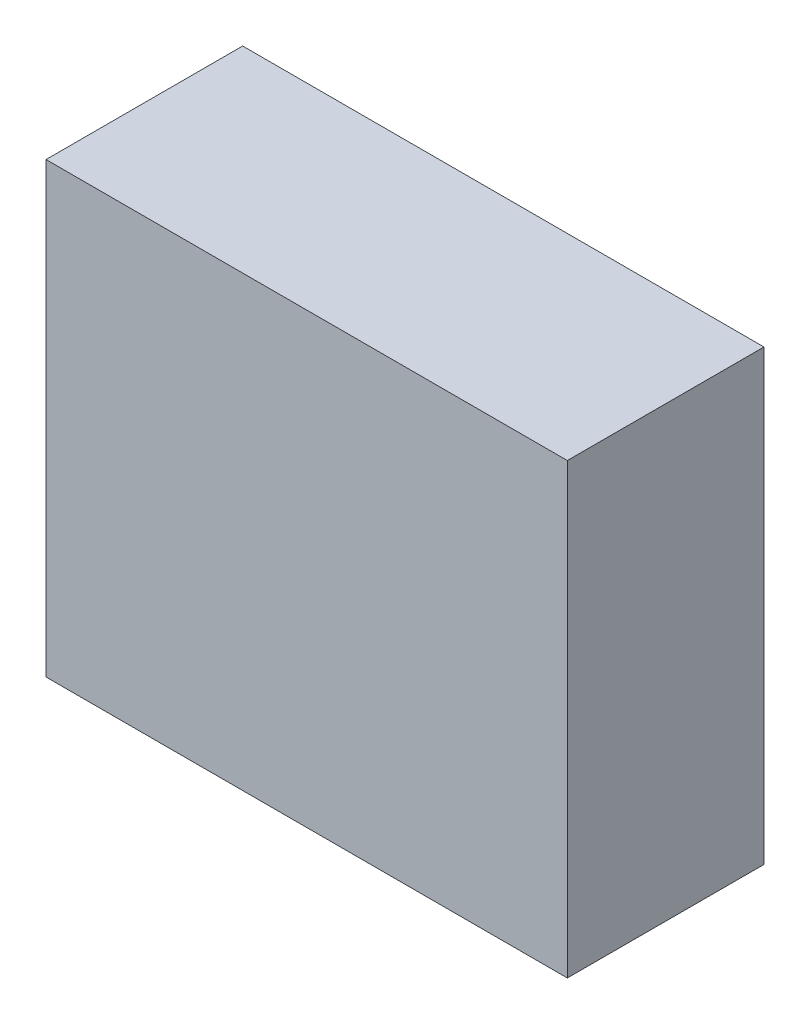
ISO-10303-21;
HEADER;
FILE_DESCRIPTION(('STEP AP214'),'2;1');
FILE_NAME('part.step','',(''),(''),'','','');
FILE_SCHEMA(('AUTOMOTIVE_DESIGN { 1 0 10303 214 1 1 1 1 }'));
ENDSEC;
DATA;
#1=APPLICATION_CONTEXT('core data for automotive mechanical design processes');
#2=APPLICATION_PROTOCOL_DEFINITION('international standard','automotive_design',2000,#1);
#3=PRODUCT_CONTEXT('',#1,'mechanical');
#4=PRODUCT('Part','Part','',(#3));
#5=PRODUCT_RELATED_PRODUCT_CATEGORY('part','',(#4));
#6=PRODUCT_DEFINITION_FORMATION('','',#4);
#7=PRODUCT_DEFINITION_CONTEXT('part definition',#1,'design');
#8=PRODUCT_DEFINITION('design','',#6,#7);
#9=PRODUCT_DEFINITION_SHAPE('','',#8);
#10=(LENGTH_UNIT() NAMED_UNIT(*) SI_UNIT(.MILLI.,.METRE.));
#11=(NAMED_UNIT(*) PLANE_ANGLE_UNIT() SI_UNIT($,.RADIAN.));
#12=(NAMED_UNIT(*) SI_UNIT($,.STERADIAN.) SOLID_ANGLE_UNIT());
#13=UNCERTAINTY_MEASURE_WITH_UNIT(LENGTH_MEASURE(1.E-05),#10,'distance_accuracy_value','');
#14=(GEOMETRIC_REPRESENTATION_CONTEXT(3) GLOBAL_UNCERTAINTY_ASSIGNED_CONTEXT((#13)) GLOBAL_UNIT_ASSIGNED_CONTEXT((#10,
#11,#12)) REPRESENTATION_CONTEXT('',''));
#15=CARTESIAN_POINT('',(0.,0.,0.));
#16=DIRECTION('',(0.,0.,1.));
#17=DIRECTION('',(1.,0.,0.));
#18=AXIS2_PLACEMENT_3D('',#15,#16,#17);
#19=CARTESIAN_POINT('',(62.465712,52.602384,1.82372));
#20=DIRECTION('',(0.,0.,1.));
#21=DIRECTION('',(-1.,0.,0.));
#22=AXIS2_PLACEMENT_3D('',#19,#20,#21);
#23=PLANE('',#22);
#24=DIRECTION('',(-1.,0.,0.));
#25=VECTOR('',#24,1.);
#26=CARTESIAN_POINT('',(60.96,50.0634,1.82372));
#27=LINE('',#26,#25);
#28=CARTESIAN_POINT('',(59.5122,50.0634,1.82372));
#29=VERTEX_POINT('',#28);
#30=CARTESIAN_POINT('',(62.4078,50.0634,1.82372));
#31=VERTEX_POINT('',#30);
#32=EDGE_CURVE('E76',#29,#31,#27,.F.);
#33=ORIENTED_EDGE('',*,*,#32,.T.);
#34=DIRECTION('',(0.,-1.,0.));
#35=VECTOR('',#34,1.);
#36=CARTESIAN_POINT('',(62.4078,51.308,1.82372));
#37=LINE('',#36,#35);
#38=CARTESIAN_POINT('',(62.4078,52.5526,1.82372));
#39=VERTEX_POINT('',#38);
#40=EDGE_CURVE('E58',#31,#39,#37,.F.);
#41=ORIENTED_EDGE('',*,*,#40,.T.);
#42=DIRECTION('',(1.,0.,0.));
#43=VECTOR('',#42,1.);
#44=CARTESIAN_POINT('',(60.96,52.5526,1.82372));
#45=LINE('',#44,#43);
#46=CARTESIAN_POINT('',(59.5122,52.5526,1.82372));
#47=VERTEX_POINT('',#46);
#48=EDGE_CURVE('E20',#39,#47,#45,.F.);
#49=ORIENTED_EDGE('',*,*,#48,.T.);
#50=DIRECTION('',(0.,1.,0.));
#51=VECTOR('',#50,1.);
#52=CARTESIAN_POINT('',(59.5122,51.308,1.82372));
#53=LINE('',#52,#51);
#54=EDGE_CURVE('E55',#47,#29,#53,.F.);
#55=ORIENTED_EDGE('',*,*,#54,.T.);
#56=EDGE_LOOP('',(#33,#41,#49,#55));
#57=FACE_BOUND('',#56,.T.);
#58=ADVANCED_FACE('F16',(#57),#23,.T.);
#59=CARTESIAN_POINT('',(62.465712,52.5526,0.709676));
#60=DIRECTION('',(0.,1.,0.));
#61=DIRECTION('',(-1.,0.,0.));
#62=AXIS2_PLACEMENT_3D('',#59,#60,#61);
#63=PLANE('',#62);
#64=ORIENTED_EDGE('',*,*,#48,.F.);
#65=DIRECTION('',(0.,0.,1.));
#66=VECTOR('',#65,1.);
#67=CARTESIAN_POINT('',(62.4078,52.5526,1.27762));
#68=LINE('',#67,#66);
#69=CARTESIAN_POINT('',(62.4078,52.5526,0.73152));
#70=VERTEX_POINT('',#69);
#71=EDGE_CURVE('E80',#39,#70,#68,.F.);
#72=ORIENTED_EDGE('',*,*,#71,.T.);
#73=DIRECTION('',(-1.,0.,0.));
#74=VECTOR('',#73,1.);
#75=CARTESIAN_POINT('',(60.96,52.5526,0.73152));
#76=LINE('',#75,#74);
#77=CARTESIAN_POINT('',(59.5122,52.5526,0.73152));
#78=VERTEX_POINT('',#77);
#79=EDGE_CURVE('E73',#70,#78,#76,.T.);
#80=ORIENTED_EDGE('',*,*,#79,.T.);
#81=DIRECTION('',(0.,0.,-1.));
#82=VECTOR('',#81,1.);
#83=CARTESIAN_POINT('',(59.5122,52.5526,1.27762));
#84=LINE('',#83,#82);
#85=EDGE_CURVE('E63',#78,#47,#84,.F.);
#86=ORIENTED_EDGE('',*,*,#85,.T.);
#87=EDGE_LOOP('',(#64,#72,#80,#86));
#88=FACE_BOUND('',#87,.T.);
#89=ADVANCED_FACE('F72',(#88),#63,.T.);
#90=CARTESIAN_POINT('',(59.5122,52.602384,0.709676));
#91=DIRECTION('',(-1.,0.,0.));
#92=DIRECTION('',(0.,-1.,0.));
#93=AXIS2_PLACEMENT_3D('',#90,#91,#92);
#94=PLANE('',#93);
#95=ORIENTED_EDGE('',*,*,#54,.F.);
#96=ORIENTED_EDGE('',*,*,#85,.F.);
#97=DIRECTION('',(0.,-1.,0.));
#98=VECTOR('',#97,1.);
#99=CARTESIAN_POINT('',(59.5122,51.308,0.73152));
#100=LINE('',#99,#98);
#101=CARTESIAN_POINT('',(59.5122,50.0634,0.73152));
#102=VERTEX_POINT('',#101);
#103=EDGE_CURVE('E83',#78,#102,#100,.T.);
#104=ORIENTED_EDGE('',*,*,#103,.T.);
#105=DIRECTION('',(0.,0.,-1.));
#106=VECTOR('',#105,1.);
#107=CARTESIAN_POINT('',(59.5122,50.0634,1.27762));
#108=LINE('',#107,#106);
#109=EDGE_CURVE('E69',#102,#29,#108,.F.);
#110=ORIENTED_EDGE('',*,*,#109,.T.);
#111=EDGE_LOOP('',(#95,#96,#104,#110));
#112=FACE_BOUND('',#111,.T.);
#113=ADVANCED_FACE('F66',(#112),#94,.T.);
#114=CARTESIAN_POINT('',(59.454288,50.0634,0.709676));
#115=DIRECTION('',(0.,-1.,0.));
#116=DIRECTION('',(1.,0.,0.));
#117=AXIS2_PLACEMENT_3D('',#114,#115,#116);
#118=PLANE('',#117);
#119=ORIENTED_EDGE('',*,*,#32,.F.);
#120=ORIENTED_EDGE('',*,*,#109,.F.);
#121=DIRECTION('',(1.,0.,0.));
#122=VECTOR('',#121,1.);
#123=CARTESIAN_POINT('',(60.96,50.0634,0.73152));
#124=LINE('',#123,#122);
#125=CARTESIAN_POINT('',(62.4078,50.0634,0.73152));
#126=VERTEX_POINT('',#125);
#127=EDGE_CURVE('E26',#102,#126,#124,.T.);
#128=ORIENTED_EDGE('',*,*,#127,.T.);
#129=DIRECTION('',(0.,0.,-1.));
#130=VECTOR('',#129,1.);
#131=CARTESIAN_POINT('',(62.4078,50.0634,1.27762));
#132=LINE('',#131,#130);
#133=EDGE_CURVE('E34',#126,#31,#132,.F.);
#134=ORIENTED_EDGE('',*,*,#133,.T.);
#135=EDGE_LOOP('',(#119,#120,#128,#134));
#136=FACE_BOUND('',#135,.T.);
#137=ADVANCED_FACE('F88',(#136),#118,.T.);
#138=CARTESIAN_POINT('',(62.4078,50.013616,0.709676));
#139=DIRECTION('',(1.,0.,0.));
#140=DIRECTION('',(0.,1.,0.));
#141=AXIS2_PLACEMENT_3D('',#138,#139,#140);
#142=PLANE('',#141);
#143=ORIENTED_EDGE('',*,*,#40,.F.);
#144=ORIENTED_EDGE('',*,*,#133,.F.);
#145=DIRECTION('',(0.,1.,0.));
#146=VECTOR('',#145,1.);
#147=CARTESIAN_POINT('',(62.4078,51.308,0.73152));
#148=LINE('',#147,#146);
#149=EDGE_CURVE('E11',#126,#70,#148,.T.);
#150=ORIENTED_EDGE('',*,*,#149,.T.);
#151=ORIENTED_EDGE('',*,*,#71,.F.);
#152=EDGE_LOOP('',(#143,#144,#150,#151));
#153=FACE_BOUND('',#152,.T.);
#154=ADVANCED_FACE('F90',(#153),#142,.T.);
#155=CARTESIAN_POINT('',(62.465712,52.602384,0.73152));
#156=DIRECTION('',(0.,0.,1.));
#157=DIRECTION('',(-1.,0.,0.));
#158=AXIS2_PLACEMENT_3D('',#155,#156,#157);
#159=PLANE('',#158);
#160=ORIENTED_EDGE('',*,*,#127,.F.);
#161=ORIENTED_EDGE('',*,*,#103,.F.);
#162=ORIENTED_EDGE('',*,*,#79,.F.);
#163=ORIENTED_EDGE('',*,*,#149,.F.);
#164=EDGE_LOOP('',(#160,#161,#162,#163));
#165=FACE_BOUND('',#164,.T.);
#166=ADVANCED_FACE('F18',(#165),#159,.F.);
#167=CLOSED_SHELL('',(#58,#89,#113,#137,#154,#166));
#168=MANIFOLD_SOLID_BREP('B1',#167);
#169=ADVANCED_BREP_SHAPE_REPRESENTATION('',(#18,#168),#14);
#170=SHAPE_DEFINITION_REPRESENTATION(#9,#169);
ENDSEC;
END-ISO-10303-21;
